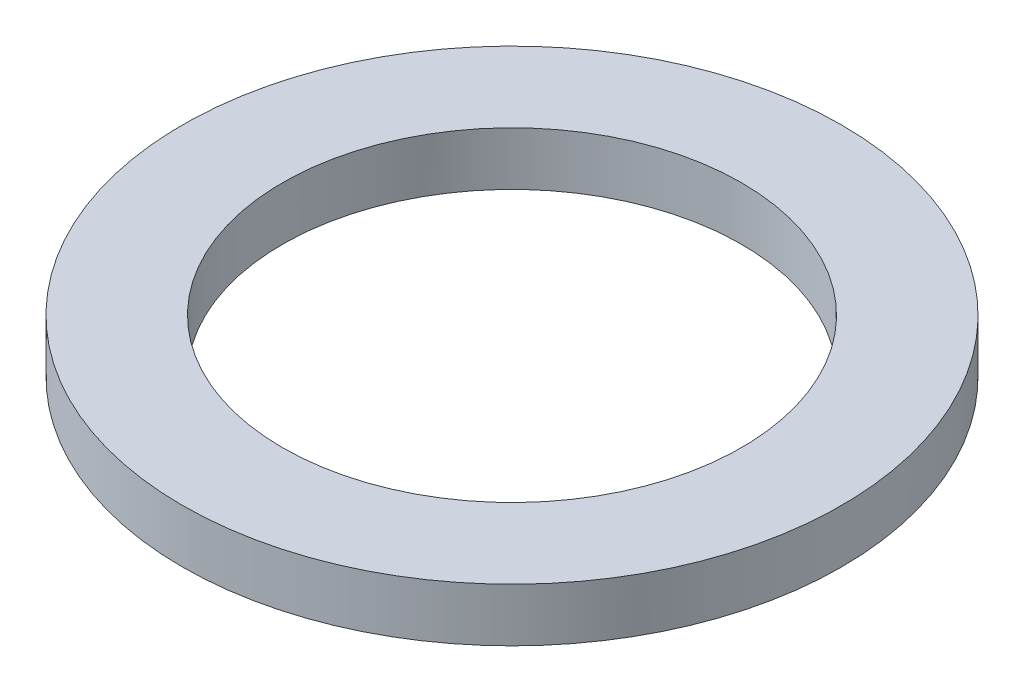
ISO-10303-21;
HEADER;
FILE_DESCRIPTION(('STEP AP214'),'2;1');
FILE_NAME('part.step','',(''),(''),'','','');
FILE_SCHEMA(('AUTOMOTIVE_DESIGN { 1 0 10303 214 1 1 1 1 }'));
ENDSEC;
DATA;
#1=APPLICATION_CONTEXT('core data for automotive mechanical design processes');
#2=APPLICATION_PROTOCOL_DEFINITION('international standard','automotive_design',2000,#1);
#3=PRODUCT_CONTEXT('',#1,'mechanical');
#4=PRODUCT('Part','Part','',(#3));
#5=PRODUCT_RELATED_PRODUCT_CATEGORY('part','',(#4));
#6=PRODUCT_DEFINITION_FORMATION('','',#4);
#7=PRODUCT_DEFINITION_CONTEXT('part definition',#1,'design');
#8=PRODUCT_DEFINITION('design','',#6,#7);
#9=PRODUCT_DEFINITION_SHAPE('','',#8);
#10=(LENGTH_UNIT() NAMED_UNIT(*) SI_UNIT(.MILLI.,.METRE.));
#11=(NAMED_UNIT(*) PLANE_ANGLE_UNIT() SI_UNIT($,.RADIAN.));
#12=(NAMED_UNIT(*) SI_UNIT($,.STERADIAN.) SOLID_ANGLE_UNIT());
#13=UNCERTAINTY_MEASURE_WITH_UNIT(LENGTH_MEASURE(1.E-05),#10,'distance_accuracy_value','');
#14=(GEOMETRIC_REPRESENTATION_CONTEXT(3) GLOBAL_UNCERTAINTY_ASSIGNED_CONTEXT((#13)) GLOBAL_UNIT_ASSIGNED_CONTEXT((#10,
#11,#12)) REPRESENTATION_CONTEXT('',''));
#15=CARTESIAN_POINT('',(0.,0.,0.));
#16=DIRECTION('',(0.,0.,1.));
#17=DIRECTION('',(1.,0.,0.));
#18=AXIS2_PLACEMENT_3D('',#15,#16,#17);
#19=CARTESIAN_POINT('',(0.,-92.3248590494139,0.));
#20=DIRECTION('',(0.,1.,0.));
#21=DIRECTION('',(0.,0.,1.));
#22=AXIS2_PLACEMENT_3D('',#19,#20,#21);
#23=CYLINDRICAL_SURFACE('',#22,30.874);
#24=CARTESIAN_POINT('',(0.,0.,0.));
#25=DIRECTION('',(0.,1.,0.));
#26=DIRECTION('',(0.,0.,1.));
#27=AXIS2_PLACEMENT_3D('',#24,#25,#26);
#28=CIRCLE('',#27,30.874);
#29=CARTESIAN_POINT('',(0.,0.,30.874));
#30=VERTEX_POINT('',#29);
#31=EDGE_CURVE('E42',#30,#30,#28,.T.);
#32=ORIENTED_EDGE('',*,*,#31,.F.);
#33=EDGE_LOOP('',(#32));
#34=FACE_BOUND('',#33,.T.);
#35=CARTESIAN_POINT('',(0.,-5.,0.));
#36=DIRECTION('',(0.,-1.,0.));
#37=DIRECTION('',(1.,0.,0.));
#38=AXIS2_PLACEMENT_3D('',#35,#36,#37);
#39=CIRCLE('',#38,30.874);
#40=CARTESIAN_POINT('',(30.874,-5.,0.));
#41=VERTEX_POINT('',#40);
#42=EDGE_CURVE('E38',#41,#41,#39,.F.);
#43=ORIENTED_EDGE('',*,*,#42,.T.);
#44=EDGE_LOOP('',(#43));
#45=FACE_BOUND('',#44,.T.);
#46=ADVANCED_FACE('F34',(#34,#45),#23,.T.);
#47=CARTESIAN_POINT('',(0.,-92.3248590494139,0.));
#48=DIRECTION('',(0.,1.,0.));
#49=DIRECTION('',(0.,0.,1.));
#50=AXIS2_PLACEMENT_3D('',#47,#48,#49);
#51=CYLINDRICAL_SURFACE('',#50,21.5);
#52=CARTESIAN_POINT('',(0.,0.,0.));
#53=DIRECTION('',(0.,1.,0.));
#54=DIRECTION('',(0.,0.,1.));
#55=AXIS2_PLACEMENT_3D('',#52,#53,#54);
#56=CIRCLE('',#55,21.5);
#57=CARTESIAN_POINT('',(0.,0.,21.5));
#58=VERTEX_POINT('',#57);
#59=EDGE_CURVE('E46',#58,#58,#56,.T.);
#60=ORIENTED_EDGE('',*,*,#59,.T.);
#61=EDGE_LOOP('',(#60));
#62=FACE_BOUND('',#61,.T.);
#63=CARTESIAN_POINT('',(0.,-5.,0.));
#64=DIRECTION('',(0.,-1.,0.));
#65=DIRECTION('',(1.,0.,0.));
#66=AXIS2_PLACEMENT_3D('',#63,#64,#65);
#67=CIRCLE('',#66,21.5);
#68=CARTESIAN_POINT('',(21.5,-5.,0.));
#69=VERTEX_POINT('',#68);
#70=EDGE_CURVE('E10',#69,#69,#67,.F.);
#71=ORIENTED_EDGE('',*,*,#70,.F.);
#72=EDGE_LOOP('',(#71));
#73=FACE_BOUND('',#72,.T.);
#74=ADVANCED_FACE('F61',(#62,#73),#51,.F.);
#75=CARTESIAN_POINT('',(0.,0.,0.));
#76=DIRECTION('',(0.,1.,0.));
#77=DIRECTION('',(0.,0.,1.));
#78=AXIS2_PLACEMENT_3D('',#75,#76,#77);
#79=PLANE('',#78);
#80=ORIENTED_EDGE('',*,*,#59,.F.);
#81=EDGE_LOOP('',(#80));
#82=FACE_BOUND('',#81,.T.);
#83=ORIENTED_EDGE('',*,*,#31,.T.);
#84=EDGE_LOOP('',(#83));
#85=FACE_BOUND('',#84,.T.);
#86=ADVANCED_FACE('F57',(#82,#85),#79,.T.);
#87=CARTESIAN_POINT('',(0.,-5.00000000000001,-30.));
#88=DIRECTION('',(0.,-1.,0.));
#89=DIRECTION('',(-1.,0.,0.));
#90=AXIS2_PLACEMENT_3D('',#87,#88,#89);
#91=PLANE('',#90);
#92=ORIENTED_EDGE('',*,*,#42,.F.);
#93=EDGE_LOOP('',(#92));
#94=FACE_BOUND('',#93,.T.);
#95=ORIENTED_EDGE('',*,*,#70,.T.);
#96=EDGE_LOOP('',(#95));
#97=FACE_BOUND('',#96,.T.);
#98=ADVANCED_FACE('F36',(#94,#97),#91,.T.);
#99=CLOSED_SHELL('',(#46,#74,#86,#98));
#100=MANIFOLD_SOLID_BREP('B2',#99);
#101=ADVANCED_BREP_SHAPE_REPRESENTATION('',(#18,#100),#14);
#102=SHAPE_DEFINITION_REPRESENTATION(#9,#101);
ENDSEC;
END-ISO-10303-21;
